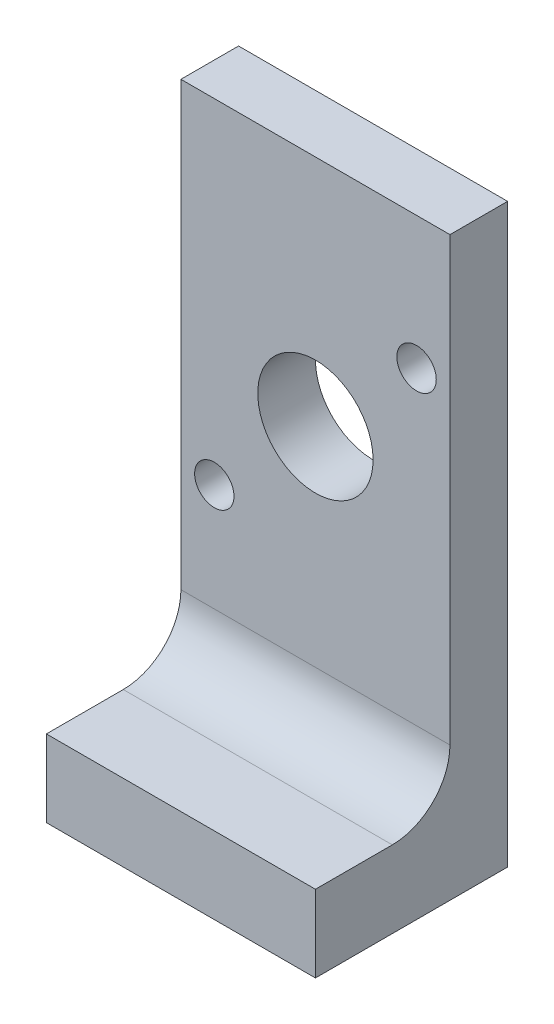
ISO-10303-21;
HEADER;
FILE_DESCRIPTION(('STEP AP214'),'2;1');
FILE_NAME('part.step','',(''),(''),'','','');
FILE_SCHEMA(('AUTOMOTIVE_DESIGN { 1 0 10303 214 1 1 1 1 }'));
ENDSEC;
DATA;
#1=APPLICATION_CONTEXT('core data for automotive mechanical design processes');
#2=APPLICATION_PROTOCOL_DEFINITION('international standard','automotive_design',2000,#1);
#3=PRODUCT_CONTEXT('',#1,'mechanical');
#4=PRODUCT('Part','Part','',(#3));
#5=PRODUCT_RELATED_PRODUCT_CATEGORY('part','',(#4));
#6=PRODUCT_DEFINITION_FORMATION('','',#4);
#7=PRODUCT_DEFINITION_CONTEXT('part definition',#1,'design');
#8=PRODUCT_DEFINITION('design','',#6,#7);
#9=PRODUCT_DEFINITION_SHAPE('','',#8);
#10=(LENGTH_UNIT() NAMED_UNIT(*) SI_UNIT(.MILLI.,.METRE.));
#11=(NAMED_UNIT(*) PLANE_ANGLE_UNIT() SI_UNIT($,.RADIAN.));
#12=(NAMED_UNIT(*) SI_UNIT($,.STERADIAN.) SOLID_ANGLE_UNIT());
#13=UNCERTAINTY_MEASURE_WITH_UNIT(LENGTH_MEASURE(1.E-05),#10,'distance_accuracy_value','');
#14=(GEOMETRIC_REPRESENTATION_CONTEXT(3) GLOBAL_UNCERTAINTY_ASSIGNED_CONTEXT((#13)) GLOBAL_UNIT_ASSIGNED_CONTEXT((#10,
#11,#12)) REPRESENTATION_CONTEXT('',''));
#15=CARTESIAN_POINT('',(0.,0.,0.));
#16=DIRECTION('',(0.,0.,1.));
#17=DIRECTION('',(1.,0.,0.));
#18=AXIS2_PLACEMENT_3D('',#15,#16,#17);
#19=CARTESIAN_POINT('',(14.,4.,0.));
#20=DIRECTION('',(0.,0.,-1.));
#21=DIRECTION('',(0.,1.,0.));
#22=AXIS2_PLACEMENT_3D('',#19,#20,#21);
#23=PLANE('',#22);
#24=DIRECTION('',(0.,-1.,0.));
#25=VECTOR('',#24,1.);
#26=CARTESIAN_POINT('',(0.,4.,0.));
#27=LINE('',#26,#25);
#28=CARTESIAN_POINT('',(0.,4.,0.));
#29=VERTEX_POINT('',#28);
#30=CARTESIAN_POINT('',(0.,0.,0.));
#31=VERTEX_POINT('',#30);
#32=EDGE_CURVE('E126',#29,#31,#27,.T.);
#33=ORIENTED_EDGE('',*,*,#32,.T.);
#34=DIRECTION('',(-1.,0.,0.));
#35=VECTOR('',#34,1.);
#36=CARTESIAN_POINT('',(14.,0.,0.));
#37=LINE('',#36,#35);
#38=CARTESIAN_POINT('',(14.,0.,0.));
#39=VERTEX_POINT('',#38);
#40=EDGE_CURVE('E11',#39,#31,#37,.T.);
#41=ORIENTED_EDGE('',*,*,#40,.F.);
#42=DIRECTION('',(0.,-1.,0.));
#43=VECTOR('',#42,1.);
#44=CARTESIAN_POINT('',(14.,4.,0.));
#45=LINE('',#44,#43);
#46=CARTESIAN_POINT('',(14.,4.,0.));
#47=VERTEX_POINT('',#46);
#48=EDGE_CURVE('E139',#47,#39,#45,.T.);
#49=ORIENTED_EDGE('',*,*,#48,.F.);
#50=DIRECTION('',(-1.,0.,0.));
#51=VECTOR('',#50,1.);
#52=CARTESIAN_POINT('',(14.,4.,0.));
#53=LINE('',#52,#51);
#54=EDGE_CURVE('E122',#47,#29,#53,.T.);
#55=ORIENTED_EDGE('',*,*,#54,.T.);
#56=EDGE_LOOP('',(#33,#41,#49,#55));
#57=FACE_BOUND('',#56,.T.);
#58=ADVANCED_FACE('F33',(#57),#23,.F.);
#59=CARTESIAN_POINT('',(14.,0.,0.));
#60=DIRECTION('',(0.,1.,0.));
#61=DIRECTION('',(0.,0.,1.));
#62=AXIS2_PLACEMENT_3D('',#59,#60,#61);
#63=PLANE('',#62);
#64=CARTESIAN_POINT('',(11.,0.,-7.));
#65=DIRECTION('',(0.,-1.,0.));
#66=DIRECTION('',(0.,0.,-1.));
#67=AXIS2_PLACEMENT_3D('',#64,#65,#66);
#68=CIRCLE('',#67,1.24999999999999);
#69=CARTESIAN_POINT('',(11.,0.,-8.24999999999999));
#70=VERTEX_POINT('',#69);
#71=EDGE_CURVE('E170',#70,#70,#68,.T.);
#72=ORIENTED_EDGE('',*,*,#71,.F.);
#73=EDGE_LOOP('',(#72));
#74=FACE_BOUND('',#73,.T.);
#75=CARTESIAN_POINT('',(3.,0.,-3.));
#76=DIRECTION('',(0.,-1.,0.));
#77=DIRECTION('',(0.,0.,-1.));
#78=AXIS2_PLACEMENT_3D('',#75,#76,#77);
#79=CIRCLE('',#78,1.24999999999999);
#80=CARTESIAN_POINT('',(3.,0.,-4.24999999999999));
#81=VERTEX_POINT('',#80);
#82=EDGE_CURVE('E164',#81,#81,#79,.T.);
#83=ORIENTED_EDGE('',*,*,#82,.F.);
#84=EDGE_LOOP('',(#83));
#85=FACE_BOUND('',#84,.T.);
#86=DIRECTION('',(0.,0.,-1.));
#87=VECTOR('',#86,1.);
#88=CARTESIAN_POINT('',(0.,0.,0.));
#89=LINE('',#88,#87);
#90=CARTESIAN_POINT('',(0.,0.,-10.));
#91=VERTEX_POINT('',#90);
#92=EDGE_CURVE('E129',#31,#91,#89,.T.);
#93=ORIENTED_EDGE('',*,*,#92,.T.);
#94=DIRECTION('',(-1.,0.,0.));
#95=VECTOR('',#94,1.);
#96=CARTESIAN_POINT('',(14.,0.,-10.));
#97=LINE('',#96,#95);
#98=CARTESIAN_POINT('',(14.,0.,-10.));
#99=VERTEX_POINT('',#98);
#100=EDGE_CURVE('E41',#99,#91,#97,.T.);
#101=ORIENTED_EDGE('',*,*,#100,.F.);
#102=DIRECTION('',(0.,0.,-1.));
#103=VECTOR('',#102,1.);
#104=CARTESIAN_POINT('',(14.,0.,0.));
#105=LINE('',#104,#103);
#106=EDGE_CURVE('E90',#39,#99,#105,.T.);
#107=ORIENTED_EDGE('',*,*,#106,.F.);
#108=ORIENTED_EDGE('',*,*,#40,.T.);
#109=EDGE_LOOP('',(#93,#101,#107,#108));
#110=FACE_BOUND('',#109,.T.);
#111=ADVANCED_FACE('F210',(#74,#85,#110),#63,.F.);
#112=CARTESIAN_POINT('',(14.,0.,-10.));
#113=DIRECTION('',(0.,0.,1.));
#114=DIRECTION('',(1.,0.,0.));
#115=AXIS2_PLACEMENT_3D('',#112,#113,#114);
#116=PLANE('',#115);
#117=CARTESIAN_POINT('',(1.73756991305345,12.5875699130535,-10.));
#118=DIRECTION('',(0.,0.,1.));
#119=DIRECTION('',(1.,0.,0.));
#120=AXIS2_PLACEMENT_3D('',#117,#118,#119);
#121=CIRCLE('',#120,1.02499999999999);
#122=CARTESIAN_POINT('',(2.76256991305344,12.5875699130535,-10.));
#123=VERTEX_POINT('',#122);
#124=EDGE_CURVE('E185',#123,#123,#121,.T.);
#125=ORIENTED_EDGE('',*,*,#124,.T.);
#126=EDGE_LOOP('',(#125));
#127=FACE_BOUND('',#126,.T.);
#128=CARTESIAN_POINT('',(12.2624300869465,23.1124300869465,-10.));
#129=DIRECTION('',(0.,0.,1.));
#130=DIRECTION('',(1.,0.,0.));
#131=AXIS2_PLACEMENT_3D('',#128,#129,#130);
#132=CIRCLE('',#131,1.02499999999999);
#133=CARTESIAN_POINT('',(13.2874300869465,23.1124300869465,-10.));
#134=VERTEX_POINT('',#133);
#135=EDGE_CURVE('E179',#134,#134,#132,.T.);
#136=ORIENTED_EDGE('',*,*,#135,.T.);
#137=EDGE_LOOP('',(#136));
#138=FACE_BOUND('',#137,.T.);
#139=CARTESIAN_POINT('',(7.,17.85,-10.));
#140=DIRECTION('',(0.,0.,1.));
#141=DIRECTION('',(1.,0.,0.));
#142=AXIS2_PLACEMENT_3D('',#139,#140,#141);
#143=CIRCLE('',#142,3.);
#144=CARTESIAN_POINT('',(10.,17.85,-10.));
#145=VERTEX_POINT('',#144);
#146=EDGE_CURVE('E173',#145,#145,#143,.F.);
#147=ORIENTED_EDGE('',*,*,#146,.F.);
#148=EDGE_LOOP('',(#147));
#149=FACE_BOUND('',#148,.T.);
#150=DIRECTION('',(0.,1.,0.));
#151=VECTOR('',#150,1.);
#152=CARTESIAN_POINT('',(0.,0.,-10.));
#153=LINE('',#152,#151);
#154=CARTESIAN_POINT('',(0.,30.,-10.));
#155=VERTEX_POINT('',#154);
#156=EDGE_CURVE('E132',#91,#155,#153,.T.);
#157=ORIENTED_EDGE('',*,*,#156,.T.);
#158=DIRECTION('',(-1.,0.,0.));
#159=VECTOR('',#158,1.);
#160=CARTESIAN_POINT('',(14.,30.,-10.));
#161=LINE('',#160,#159);
#162=CARTESIAN_POINT('',(14.,30.,-10.));
#163=VERTEX_POINT('',#162);
#164=EDGE_CURVE('E143',#163,#155,#161,.T.);
#165=ORIENTED_EDGE('',*,*,#164,.F.);
#166=DIRECTION('',(0.,1.,0.));
#167=VECTOR('',#166,1.);
#168=CARTESIAN_POINT('',(14.,0.,-10.));
#169=LINE('',#168,#167);
#170=EDGE_CURVE('E151',#99,#163,#169,.T.);
#171=ORIENTED_EDGE('',*,*,#170,.F.);
#172=ORIENTED_EDGE('',*,*,#100,.T.);
#173=EDGE_LOOP('',(#157,#165,#171,#172));
#174=FACE_BOUND('',#173,.T.);
#175=ADVANCED_FACE('F149',(#127,#138,#149,#174),#116,.F.);
#176=CARTESIAN_POINT('',(14.,30.,-10.));
#177=DIRECTION('',(0.,-1.,0.));
#178=DIRECTION('',(0.,0.,-1.));
#179=AXIS2_PLACEMENT_3D('',#176,#177,#178);
#180=PLANE('',#179);
#181=DIRECTION('',(0.,0.,1.));
#182=VECTOR('',#181,1.);
#183=CARTESIAN_POINT('',(0.,30.,-10.));
#184=LINE('',#183,#182);
#185=CARTESIAN_POINT('',(0.,30.,-7.));
#186=VERTEX_POINT('',#185);
#187=EDGE_CURVE('E134',#155,#186,#184,.T.);
#188=ORIENTED_EDGE('',*,*,#187,.T.);
#189=DIRECTION('',(-1.,0.,0.));
#190=VECTOR('',#189,1.);
#191=CARTESIAN_POINT('',(14.,30.,-7.));
#192=LINE('',#191,#190);
#193=CARTESIAN_POINT('',(14.,30.,-7.));
#194=VERTEX_POINT('',#193);
#195=EDGE_CURVE('E117',#194,#186,#192,.T.);
#196=ORIENTED_EDGE('',*,*,#195,.F.);
#197=DIRECTION('',(0.,0.,1.));
#198=VECTOR('',#197,1.);
#199=CARTESIAN_POINT('',(14.,30.,-10.));
#200=LINE('',#199,#198);
#201=EDGE_CURVE('E108',#163,#194,#200,.T.);
#202=ORIENTED_EDGE('',*,*,#201,.F.);
#203=ORIENTED_EDGE('',*,*,#164,.T.);
#204=EDGE_LOOP('',(#188,#196,#202,#203));
#205=FACE_BOUND('',#204,.T.);
#206=ADVANCED_FACE('F157',(#205),#180,.F.);
#207=CARTESIAN_POINT('',(14.,30.,-7.));
#208=DIRECTION('',(0.,0.,-1.));
#209=DIRECTION('',(0.,1.,0.));
#210=AXIS2_PLACEMENT_3D('',#207,#208,#209);
#211=PLANE('',#210);
#212=CARTESIAN_POINT('',(1.73756991305345,12.5875699130535,-7.));
#213=DIRECTION('',(0.,0.,1.));
#214=DIRECTION('',(1.,0.,0.));
#215=AXIS2_PLACEMENT_3D('',#212,#213,#214);
#216=CIRCLE('',#215,1.02499999999999);
#217=CARTESIAN_POINT('',(2.76256991305343,12.5875699130535,-7.));
#218=VERTEX_POINT('',#217);
#219=EDGE_CURVE('E188',#218,#218,#216,.T.);
#220=ORIENTED_EDGE('',*,*,#219,.F.);
#221=EDGE_LOOP('',(#220));
#222=FACE_BOUND('',#221,.T.);
#223=CARTESIAN_POINT('',(12.2624300869465,23.1124300869465,-7.));
#224=DIRECTION('',(0.,0.,1.));
#225=DIRECTION('',(1.,0.,0.));
#226=AXIS2_PLACEMENT_3D('',#223,#224,#225);
#227=CIRCLE('',#226,1.02499999999999);
#228=CARTESIAN_POINT('',(13.2874300869465,23.1124300869465,-7.));
#229=VERTEX_POINT('',#228);
#230=EDGE_CURVE('E182',#229,#229,#227,.T.);
#231=ORIENTED_EDGE('',*,*,#230,.F.);
#232=EDGE_LOOP('',(#231));
#233=FACE_BOUND('',#232,.T.);
#234=CARTESIAN_POINT('',(7.,17.85,-7.00000000000001));
#235=DIRECTION('',(0.,0.,1.));
#236=DIRECTION('',(1.,0.,0.));
#237=AXIS2_PLACEMENT_3D('',#234,#235,#236);
#238=CIRCLE('',#237,3.);
#239=CARTESIAN_POINT('',(10.,17.85,-7.00000000000001));
#240=VERTEX_POINT('',#239);
#241=EDGE_CURVE('E176',#240,#240,#238,.T.);
#242=ORIENTED_EDGE('',*,*,#241,.F.);
#243=EDGE_LOOP('',(#242));
#244=FACE_BOUND('',#243,.T.);
#245=DIRECTION('',(0.,-1.,0.));
#246=VECTOR('',#245,1.);
#247=CARTESIAN_POINT('',(0.,30.,-7.));
#248=LINE('',#247,#246);
#249=CARTESIAN_POINT('',(0.,7.,-7.));
#250=VERTEX_POINT('',#249);
#251=EDGE_CURVE('E116',#186,#250,#248,.T.);
#252=ORIENTED_EDGE('',*,*,#251,.T.);
#253=DIRECTION('',(-1.,0.,0.));
#254=VECTOR('',#253,1.);
#255=CARTESIAN_POINT('',(14.,7.,-7.));
#256=LINE('',#255,#254);
#257=CARTESIAN_POINT('',(14.,7.,-7.));
#258=VERTEX_POINT('',#257);
#259=EDGE_CURVE('E113',#258,#250,#256,.T.);
#260=ORIENTED_EDGE('',*,*,#259,.F.);
#261=DIRECTION('',(0.,-1.,0.));
#262=VECTOR('',#261,1.);
#263=CARTESIAN_POINT('',(14.,30.,-7.));
#264=LINE('',#263,#262);
#265=EDGE_CURVE('E102',#194,#258,#264,.T.);
#266=ORIENTED_EDGE('',*,*,#265,.F.);
#267=ORIENTED_EDGE('',*,*,#195,.T.);
#268=EDGE_LOOP('',(#252,#260,#266,#267));
#269=FACE_BOUND('',#268,.T.);
#270=ADVANCED_FACE('F114',(#222,#233,#244,#269),#211,.F.);
#271=CARTESIAN_POINT('',(14.,7.,-4.));
#272=DIRECTION('',(-1.,0.,0.));
#273=DIRECTION('',(0.,0.,1.));
#274=AXIS2_PLACEMENT_3D('',#271,#272,#273);
#275=CYLINDRICAL_SURFACE('',#274,3.);
#276=CARTESIAN_POINT('',(0.,7.,-4.));
#277=DIRECTION('',(-1.,0.,0.));
#278=DIRECTION('',(0.,0.,1.));
#279=AXIS2_PLACEMENT_3D('',#276,#277,#278);
#280=CIRCLE('',#279,3.);
#281=CARTESIAN_POINT('',(0.,4.,-4.));
#282=VERTEX_POINT('',#281);
#283=EDGE_CURVE('E76',#250,#282,#280,.T.);
#284=ORIENTED_EDGE('',*,*,#283,.T.);
#285=DIRECTION('',(-1.,0.,0.));
#286=VECTOR('',#285,1.);
#287=CARTESIAN_POINT('',(14.,4.,-4.));
#288=LINE('',#287,#286);
#289=CARTESIAN_POINT('',(14.,4.,-4.));
#290=VERTEX_POINT('',#289);
#291=EDGE_CURVE('E118',#290,#282,#288,.T.);
#292=ORIENTED_EDGE('',*,*,#291,.F.);
#293=CARTESIAN_POINT('',(14.,7.,-4.));
#294=DIRECTION('',(-1.,0.,0.));
#295=DIRECTION('',(0.,0.,1.));
#296=AXIS2_PLACEMENT_3D('',#293,#294,#295);
#297=CIRCLE('',#296,3.);
#298=EDGE_CURVE('E106',#258,#290,#297,.T.);
#299=ORIENTED_EDGE('',*,*,#298,.F.);
#300=ORIENTED_EDGE('',*,*,#259,.T.);
#301=EDGE_LOOP('',(#284,#292,#299,#300));
#302=FACE_BOUND('',#301,.T.);
#303=ADVANCED_FACE('F120',(#302),#275,.F.);
#304=CARTESIAN_POINT('',(14.,4.,-4.));
#305=DIRECTION('',(0.,-1.,0.));
#306=DIRECTION('',(0.,0.,-1.));
#307=AXIS2_PLACEMENT_3D('',#304,#305,#306);
#308=PLANE('',#307);
#309=DIRECTION('',(0.,0.,1.));
#310=VECTOR('',#309,1.);
#311=CARTESIAN_POINT('',(0.,4.,-4.));
#312=LINE('',#311,#310);
#313=EDGE_CURVE('E82',#282,#29,#312,.T.);
#314=ORIENTED_EDGE('',*,*,#313,.T.);
#315=ORIENTED_EDGE('',*,*,#54,.F.);
#316=DIRECTION('',(0.,0.,1.));
#317=VECTOR('',#316,1.);
#318=CARTESIAN_POINT('',(14.,4.,-4.));
#319=LINE('',#318,#317);
#320=EDGE_CURVE('E49',#290,#47,#319,.T.);
#321=ORIENTED_EDGE('',*,*,#320,.F.);
#322=ORIENTED_EDGE('',*,*,#291,.T.);
#323=EDGE_LOOP('',(#314,#315,#321,#322));
#324=FACE_BOUND('',#323,.T.);
#325=ADVANCED_FACE('F226',(#324),#308,.F.);
#326=CARTESIAN_POINT('',(14.,7.,-4.));
#327=DIRECTION('',(-1.,0.,0.));
#328=DIRECTION('',(0.,0.,1.));
#329=AXIS2_PLACEMENT_3D('',#326,#327,#328);
#330=PLANE('',#329);
#331=ORIENTED_EDGE('',*,*,#48,.T.);
#332=ORIENTED_EDGE('',*,*,#106,.T.);
#333=ORIENTED_EDGE('',*,*,#170,.T.);
#334=ORIENTED_EDGE('',*,*,#201,.T.);
#335=ORIENTED_EDGE('',*,*,#265,.T.);
#336=ORIENTED_EDGE('',*,*,#298,.T.);
#337=ORIENTED_EDGE('',*,*,#320,.T.);
#338=EDGE_LOOP('',(#331,#332,#333,#334,#335,#336,#337));
#339=FACE_BOUND('',#338,.T.);
#340=ADVANCED_FACE('F104',(#339),#330,.F.);
#341=CARTESIAN_POINT('',(0.,7.,-4.));
#342=DIRECTION('',(-1.,0.,0.));
#343=DIRECTION('',(0.,0.,1.));
#344=AXIS2_PLACEMENT_3D('',#341,#342,#343);
#345=PLANE('',#344);
#346=ORIENTED_EDGE('',*,*,#32,.F.);
#347=ORIENTED_EDGE('',*,*,#313,.F.);
#348=ORIENTED_EDGE('',*,*,#283,.F.);
#349=ORIENTED_EDGE('',*,*,#251,.F.);
#350=ORIENTED_EDGE('',*,*,#187,.F.);
#351=ORIENTED_EDGE('',*,*,#156,.F.);
#352=ORIENTED_EDGE('',*,*,#92,.F.);
#353=EDGE_LOOP('',(#346,#347,#348,#349,#350,#351,#352));
#354=FACE_BOUND('',#353,.T.);
#355=ADVANCED_FACE('F155',(#354),#345,.T.);
#356=CARTESIAN_POINT('',(3.,3.,-3.));
#357=DIRECTION('',(0.,-1.,0.));
#358=DIRECTION('',(0.,0.,-1.));
#359=AXIS2_PLACEMENT_3D('',#356,#357,#358);
#360=CONICAL_SURFACE('',#359,1.24999999999999,1.02974425867665);
#361=CARTESIAN_POINT('',(3.,3.75107577378445,-3.));
#362=VERTEX_POINT('',#361);
#363=VERTEX_LOOP('',#362);
#364=FACE_BOUND('',#363,.T.);
#365=CARTESIAN_POINT('',(3.,3.,-3.));
#366=DIRECTION('',(0.,-1.,0.));
#367=DIRECTION('',(0.,0.,-1.));
#368=AXIS2_PLACEMENT_3D('',#365,#366,#367);
#369=CIRCLE('',#368,1.24999999999999);
#370=CARTESIAN_POINT('',(3.,3.,-4.24999999999999));
#371=VERTEX_POINT('',#370);
#372=EDGE_CURVE('E130',#371,#371,#369,.T.);
#373=ORIENTED_EDGE('',*,*,#372,.T.);
#374=EDGE_LOOP('',(#373));
#375=FACE_BOUND('',#374,.T.);
#376=ADVANCED_FACE('F237',(#364,#375),#360,.F.);
#377=CARTESIAN_POINT('',(3.,0.,-3.));
#378=DIRECTION('',(0.,-1.,0.));
#379=DIRECTION('',(0.,0.,-1.));
#380=AXIS2_PLACEMENT_3D('',#377,#378,#379);
#381=CYLINDRICAL_SURFACE('',#380,1.24999999999999);
#382=ORIENTED_EDGE('',*,*,#372,.F.);
#383=EDGE_LOOP('',(#382));
#384=FACE_BOUND('',#383,.T.);
#385=ORIENTED_EDGE('',*,*,#82,.T.);
#386=EDGE_LOOP('',(#385));
#387=FACE_BOUND('',#386,.T.);
#388=ADVANCED_FACE('F241',(#384,#387),#381,.F.);
#389=CARTESIAN_POINT('',(11.,3.,-7.));
#390=DIRECTION('',(0.,-1.,0.));
#391=DIRECTION('',(0.,0.,-1.));
#392=AXIS2_PLACEMENT_3D('',#389,#390,#391);
#393=CONICAL_SURFACE('',#392,1.24999999999999,1.02974425867665);
#394=CARTESIAN_POINT('',(11.,3.75107577378445,-7.));
#395=VERTEX_POINT('',#394);
#396=VERTEX_LOOP('',#395);
#397=FACE_BOUND('',#396,.T.);
#398=CARTESIAN_POINT('',(11.,3.,-7.));
#399=DIRECTION('',(0.,-1.,0.));
#400=DIRECTION('',(0.,0.,-1.));
#401=AXIS2_PLACEMENT_3D('',#398,#399,#400);
#402=CIRCLE('',#401,1.24999999999999);
#403=CARTESIAN_POINT('',(11.,3.,-8.24999999999999));
#404=VERTEX_POINT('',#403);
#405=EDGE_CURVE('E167',#404,#404,#402,.T.);
#406=ORIENTED_EDGE('',*,*,#405,.T.);
#407=EDGE_LOOP('',(#406));
#408=FACE_BOUND('',#407,.T.);
#409=ADVANCED_FACE('F245',(#397,#408),#393,.F.);
#410=CARTESIAN_POINT('',(11.,0.,-7.));
#411=DIRECTION('',(0.,-1.,0.));
#412=DIRECTION('',(0.,0.,-1.));
#413=AXIS2_PLACEMENT_3D('',#410,#411,#412);
#414=CYLINDRICAL_SURFACE('',#413,1.24999999999999);
#415=ORIENTED_EDGE('',*,*,#405,.F.);
#416=EDGE_LOOP('',(#415));
#417=FACE_BOUND('',#416,.T.);
#418=ORIENTED_EDGE('',*,*,#71,.T.);
#419=EDGE_LOOP('',(#418));
#420=FACE_BOUND('',#419,.T.);
#421=ADVANCED_FACE('F205',(#417,#420),#414,.F.);
#422=CARTESIAN_POINT('',(7.,17.85,-10.001));
#423=DIRECTION('',(0.,0.,1.));
#424=DIRECTION('',(1.,0.,0.));
#425=AXIS2_PLACEMENT_3D('',#422,#423,#424);
#426=CYLINDRICAL_SURFACE('',#425,3.);
#427=ORIENTED_EDGE('',*,*,#241,.T.);
#428=EDGE_LOOP('',(#427));
#429=FACE_BOUND('',#428,.T.);
#430=ORIENTED_EDGE('',*,*,#146,.T.);
#431=EDGE_LOOP('',(#430));
#432=FACE_BOUND('',#431,.T.);
#433=ADVANCED_FACE('F201',(#429,#432),#426,.F.);
#434=CARTESIAN_POINT('',(12.2624300869465,23.1124300869465,-7.00000000000001));
#435=DIRECTION('',(0.,0.,1.));
#436=DIRECTION('',(1.,0.,0.));
#437=AXIS2_PLACEMENT_3D('',#434,#435,#436);
#438=CYLINDRICAL_SURFACE('',#437,1.02499999999999);
#439=ORIENTED_EDGE('',*,*,#135,.F.);
#440=EDGE_LOOP('',(#439));
#441=FACE_BOUND('',#440,.T.);
#442=ORIENTED_EDGE('',*,*,#230,.T.);
#443=EDGE_LOOP('',(#442));
#444=FACE_BOUND('',#443,.T.);
#445=ADVANCED_FACE('F204',(#441,#444),#438,.F.);
#446=CARTESIAN_POINT('',(1.73756991305345,12.5875699130535,-7.00000000000001));
#447=DIRECTION('',(0.,0.,1.));
#448=DIRECTION('',(1.,0.,0.));
#449=AXIS2_PLACEMENT_3D('',#446,#447,#448);
#450=CYLINDRICAL_SURFACE('',#449,1.02499999999999);
#451=ORIENTED_EDGE('',*,*,#124,.F.);
#452=EDGE_LOOP('',(#451));
#453=FACE_BOUND('',#452,.T.);
#454=ORIENTED_EDGE('',*,*,#219,.T.);
#455=EDGE_LOOP('',(#454));
#456=FACE_BOUND('',#455,.T.);
#457=ADVANCED_FACE('F192',(#453,#456),#450,.F.);
#458=CLOSED_SHELL('',(#58,#111,#175,#206,#270,#303,#325,#340,#355,#376,#388,#409,#421,#433,#445,#457));
#459=MANIFOLD_SOLID_BREP('B2',#458);
#460=ADVANCED_BREP_SHAPE_REPRESENTATION('',(#18,#459),#14);
#461=SHAPE_DEFINITION_REPRESENTATION(#9,#460);
ENDSEC;
END-ISO-10303-21;
